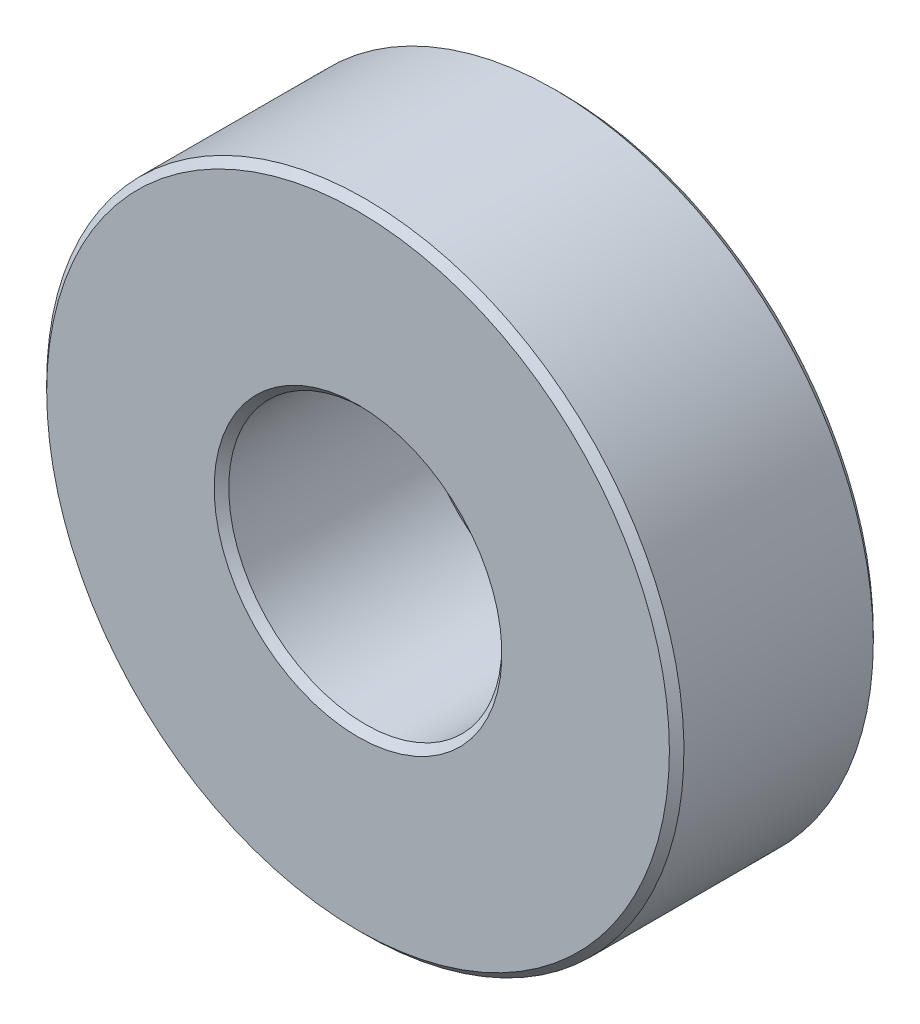
ISO-10303-21;
HEADER;
FILE_DESCRIPTION(('STEP AP214'),'2;1');
FILE_NAME('part.step','',(''),(''),'','','');
FILE_SCHEMA(('AUTOMOTIVE_DESIGN { 1 0 10303 214 1 1 1 1 }'));
ENDSEC;
DATA;
#1=APPLICATION_CONTEXT('core data for automotive mechanical design processes');
#2=APPLICATION_PROTOCOL_DEFINITION('international standard','automotive_design',2000,#1);
#3=PRODUCT_CONTEXT('',#1,'mechanical');
#4=PRODUCT('Part','Part','',(#3));
#5=PRODUCT_RELATED_PRODUCT_CATEGORY('part','',(#4));
#6=PRODUCT_DEFINITION_FORMATION('','',#4);
#7=PRODUCT_DEFINITION_CONTEXT('part definition',#1,'design');
#8=PRODUCT_DEFINITION('design','',#6,#7);
#9=PRODUCT_DEFINITION_SHAPE('','',#8);
#10=(LENGTH_UNIT() NAMED_UNIT(*) SI_UNIT(.MILLI.,.METRE.));
#11=(NAMED_UNIT(*) PLANE_ANGLE_UNIT() SI_UNIT($,.RADIAN.));
#12=(NAMED_UNIT(*) SI_UNIT($,.STERADIAN.) SOLID_ANGLE_UNIT());
#13=UNCERTAINTY_MEASURE_WITH_UNIT(LENGTH_MEASURE(1.E-05),#10,'distance_accuracy_value','');
#14=(GEOMETRIC_REPRESENTATION_CONTEXT(3) GLOBAL_UNCERTAINTY_ASSIGNED_CONTEXT((#13)) GLOBAL_UNIT_ASSIGNED_CONTEXT((#10,
#11,#12)) REPRESENTATION_CONTEXT('',''));
#15=CARTESIAN_POINT('',(0.,0.,0.));
#16=DIRECTION('',(0.,0.,1.));
#17=DIRECTION('',(1.,0.,0.));
#18=AXIS2_PLACEMENT_3D('',#15,#16,#17);
#19=CARTESIAN_POINT('',(0.,0.,0.));
#20=DIRECTION('',(0.,0.,-1.));
#21=DIRECTION('',(0.,1.,0.));
#22=AXIS2_PLACEMENT_3D('',#19,#20,#21);
#23=PLANE('',#22);
#24=CARTESIAN_POINT('',(0.,0.,-5.6843418860808E-11));
#25=DIRECTION('',(0.,0.,-1.));
#26=DIRECTION('',(0.,1.,0.));
#27=AXIS2_PLACEMENT_3D('',#24,#25,#26);
#28=CIRCLE('',#27,5.01650000001064);
#29=CARTESIAN_POINT('',(0.,5.01650000001064,-5.6843418860808E-11));
#30=VERTEX_POINT('',#29);
#31=EDGE_CURVE('E31',#30,#30,#28,.F.);
#32=ORIENTED_EDGE('',*,*,#31,.T.);
#33=EDGE_LOOP('',(#32));
#34=FACE_BOUND('',#33,.T.);
#35=CARTESIAN_POINT('',(0.,0.,0.));
#36=DIRECTION('',(0.,0.,1.));
#37=DIRECTION('',(1.,0.,0.));
#38=AXIS2_PLACEMENT_3D('',#35,#36,#37);
#39=CIRCLE('',#38,10.8585);
#40=CARTESIAN_POINT('',(10.8585,0.,0.));
#41=VERTEX_POINT('',#40);
#42=EDGE_CURVE('E17',#41,#41,#39,.T.);
#43=ORIENTED_EDGE('',*,*,#42,.F.);
#44=EDGE_LOOP('',(#43));
#45=FACE_BOUND('',#44,.T.);
#46=ADVANCED_FACE('F14',(#34,#45),#23,.T.);
#47=CARTESIAN_POINT('',(0.,0.,0.253999999999989));
#48=DIRECTION('',(0.,0.,1.));
#49=DIRECTION('',(1.,0.,0.));
#50=AXIS2_PLACEMENT_3D('',#47,#48,#49);
#51=CONICAL_SURFACE('',#50,11.1125,0.785398163397451);
#52=ORIENTED_EDGE('',*,*,#42,.T.);
#53=EDGE_LOOP('',(#52));
#54=FACE_BOUND('',#53,.T.);
#55=CARTESIAN_POINT('',(0.,0.,0.253999999999976));
#56=DIRECTION('',(0.,0.,-1.));
#57=DIRECTION('',(0.,1.,0.));
#58=AXIS2_PLACEMENT_3D('',#55,#56,#57);
#59=CIRCLE('',#58,11.1125);
#60=CARTESIAN_POINT('',(0.,11.1125,0.253999999999976));
#61=VERTEX_POINT('',#60);
#62=EDGE_CURVE('E29',#61,#61,#59,.F.);
#63=ORIENTED_EDGE('',*,*,#62,.F.);
#64=EDGE_LOOP('',(#63));
#65=FACE_BOUND('',#64,.T.);
#66=ADVANCED_FACE('F40',(#54,#65),#51,.T.);
#67=CARTESIAN_POINT('',(0.,0.,-5.6843418860808E-11));
#68=DIRECTION('',(0.,0.,-1.));
#69=DIRECTION('',(0.,1.,0.));
#70=AXIS2_PLACEMENT_3D('',#67,#68,#69);
#71=CONICAL_SURFACE('',#70,5.01650000001064,0.785398163285552);
#72=ORIENTED_EDGE('',*,*,#31,.F.);
#73=EDGE_LOOP('',(#72));
#74=FACE_BOUND('',#73,.T.);
#75=CARTESIAN_POINT('',(0.,0.,0.253999999999976));
#76=DIRECTION('',(0.,0.,-1.));
#77=DIRECTION('',(0.,1.,0.));
#78=AXIS2_PLACEMENT_3D('',#75,#76,#77);
#79=CIRCLE('',#78,4.7625);
#80=CARTESIAN_POINT('',(0.,4.7625,0.253999999999976));
#81=VERTEX_POINT('',#80);
#82=EDGE_CURVE('E36',#81,#81,#79,.F.);
#83=ORIENTED_EDGE('',*,*,#82,.T.);
#84=EDGE_LOOP('',(#83));
#85=FACE_BOUND('',#84,.T.);
#86=ADVANCED_FACE('F48',(#74,#85),#71,.F.);
#87=CARTESIAN_POINT('',(0.,0.,7.11200000000001));
#88=DIRECTION('',(0.,0.,-1.));
#89=DIRECTION('',(0.,1.,0.));
#90=AXIS2_PLACEMENT_3D('',#87,#88,#89);
#91=CYLINDRICAL_SURFACE('',#90,11.1125);
#92=CARTESIAN_POINT('',(0.,0.,6.85799999999998));
#93=DIRECTION('',(0.,0.,-1.));
#94=DIRECTION('',(-1.,0.,0.));
#95=AXIS2_PLACEMENT_3D('',#92,#93,#94);
#96=CIRCLE('',#95,11.1125);
#97=CARTESIAN_POINT('',(-11.1125,0.,6.85799999999997));
#98=VERTEX_POINT('',#97);
#99=EDGE_CURVE('E79',#98,#98,#96,.F.);
#100=ORIENTED_EDGE('',*,*,#99,.F.);
#101=EDGE_LOOP('',(#100));
#102=FACE_BOUND('',#101,.T.);
#103=ORIENTED_EDGE('',*,*,#62,.T.);
#104=EDGE_LOOP('',(#103));
#105=FACE_BOUND('',#104,.T.);
#106=ADVANCED_FACE('F67',(#102,#105),#91,.T.);
#107=CARTESIAN_POINT('',(0.,0.,7.11200000000001));
#108=DIRECTION('',(0.,0.,-1.));
#109=DIRECTION('',(0.,1.,0.));
#110=AXIS2_PLACEMENT_3D('',#107,#108,#109);
#111=CYLINDRICAL_SURFACE('',#110,4.7625);
#112=ORIENTED_EDGE('',*,*,#82,.F.);
#113=EDGE_LOOP('',(#112));
#114=FACE_BOUND('',#113,.T.);
#115=CARTESIAN_POINT('',(0.,0.,6.85800000002246));
#116=DIRECTION('',(0.,0.,1.));
#117=DIRECTION('',(1.,0.,0.));
#118=AXIS2_PLACEMENT_3D('',#115,#116,#117);
#119=CIRCLE('',#118,4.76250000002665);
#120=CARTESIAN_POINT('',(4.76250000002665,0.,6.85800000002246));
#121=VERTEX_POINT('',#120);
#122=EDGE_CURVE('E26',#121,#121,#119,.T.);
#123=ORIENTED_EDGE('',*,*,#122,.T.);
#124=EDGE_LOOP('',(#123));
#125=FACE_BOUND('',#124,.T.);
#126=ADVANCED_FACE('F63',(#114,#125),#111,.F.);
#127=CARTESIAN_POINT('',(0.,0.,6.85799999999997));
#128=DIRECTION('',(0.,0.,-1.));
#129=DIRECTION('',(0.,1.,0.));
#130=AXIS2_PLACEMENT_3D('',#127,#128,#129);
#131=CONICAL_SURFACE('',#130,11.1125,0.78539816339745);
#132=CARTESIAN_POINT('',(0.,0.,7.11199999999999));
#133=DIRECTION('',(0.,0.,-1.));
#134=DIRECTION('',(0.,1.,0.));
#135=AXIS2_PLACEMENT_3D('',#132,#133,#134);
#136=CIRCLE('',#135,10.8585);
#137=CARTESIAN_POINT('',(0.,10.8585,7.11199999999999));
#138=VERTEX_POINT('',#137);
#139=EDGE_CURVE('E21',#138,#138,#136,.T.);
#140=ORIENTED_EDGE('',*,*,#139,.T.);
#141=EDGE_LOOP('',(#140));
#142=FACE_BOUND('',#141,.T.);
#143=ORIENTED_EDGE('',*,*,#99,.T.);
#144=EDGE_LOOP('',(#143));
#145=FACE_BOUND('',#144,.T.);
#146=ADVANCED_FACE('F57',(#142,#145),#131,.T.);
#147=CARTESIAN_POINT('',(0.,0.,7.11200000000645));
#148=DIRECTION('',(0.,0.,1.));
#149=DIRECTION('',(0.,-1.,0.));
#150=AXIS2_PLACEMENT_3D('',#147,#148,#149);
#151=CONICAL_SURFACE('',#150,5.01650000001064,0.785398163397448);
#152=CARTESIAN_POINT('',(0.,0.,7.11200000000645));
#153=DIRECTION('',(0.,0.,1.));
#154=DIRECTION('',(0.,-1.,0.));
#155=AXIS2_PLACEMENT_3D('',#152,#153,#154);
#156=CIRCLE('',#155,5.01650000001064);
#157=CARTESIAN_POINT('',(0.,-5.01650000001064,7.11200000000645));
#158=VERTEX_POINT('',#157);
#159=EDGE_CURVE('E10',#158,#158,#156,.T.);
#160=ORIENTED_EDGE('',*,*,#159,.T.);
#161=EDGE_LOOP('',(#160));
#162=FACE_BOUND('',#161,.T.);
#163=ORIENTED_EDGE('',*,*,#122,.F.);
#164=EDGE_LOOP('',(#163));
#165=FACE_BOUND('',#164,.T.);
#166=ADVANCED_FACE('F51',(#162,#165),#151,.F.);
#167=CARTESIAN_POINT('',(0.,0.,7.11200000000001));
#168=DIRECTION('',(0.,0.,-1.));
#169=DIRECTION('',(0.,1.,0.));
#170=AXIS2_PLACEMENT_3D('',#167,#168,#169);
#171=PLANE('',#170);
#172=ORIENTED_EDGE('',*,*,#159,.F.);
#173=EDGE_LOOP('',(#172));
#174=FACE_BOUND('',#173,.T.);
#175=ORIENTED_EDGE('',*,*,#139,.F.);
#176=EDGE_LOOP('',(#175));
#177=FACE_BOUND('',#176,.T.);
#178=ADVANCED_FACE('F49',(#174,#177),#171,.F.);
#179=CLOSED_SHELL('',(#46,#66,#86,#106,#126,#146,#166,#178));
#180=MANIFOLD_SOLID_BREP('B1',#179);
#181=ADVANCED_BREP_SHAPE_REPRESENTATION('',(#18,#180),#14);
#182=SHAPE_DEFINITION_REPRESENTATION(#9,#181);
ENDSEC;
END-ISO-10303-21;
